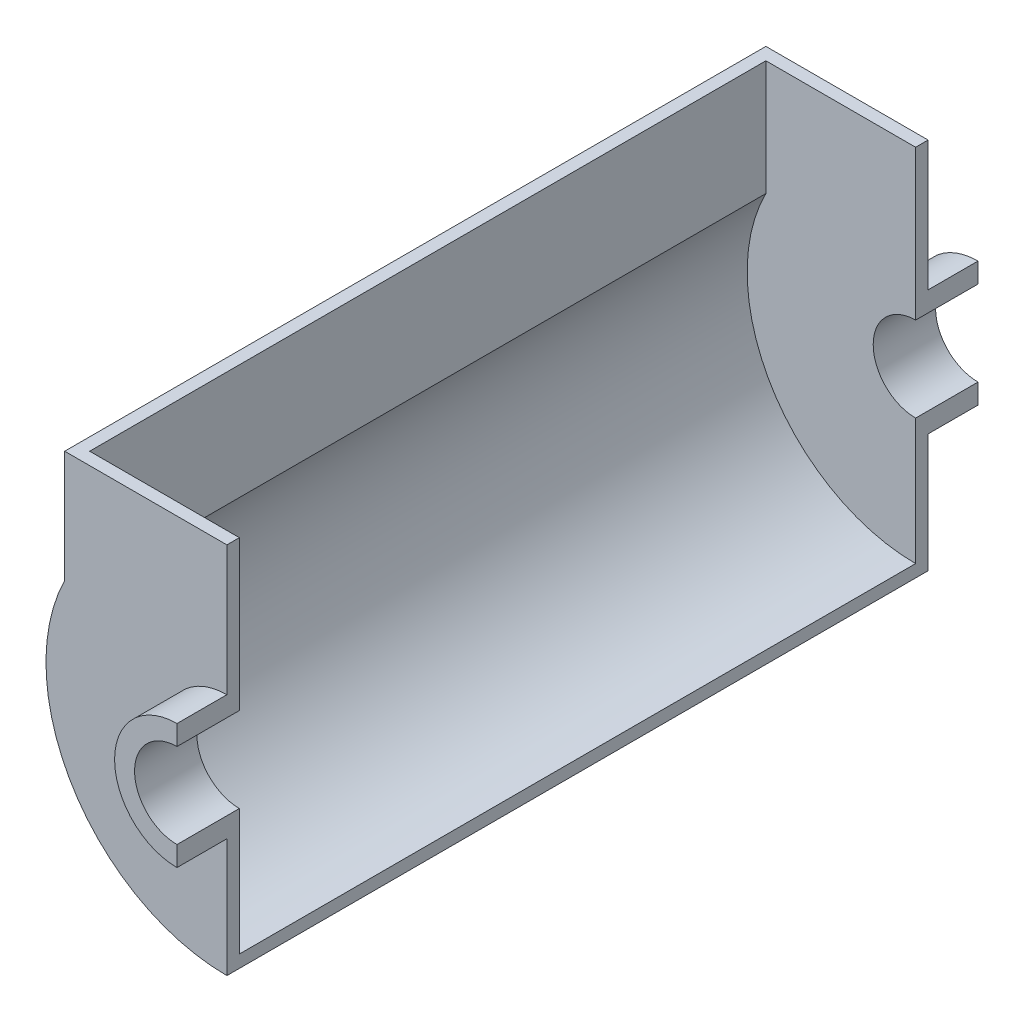
ISO-10303-21;
HEADER;
FILE_DESCRIPTION(('STEP AP214'),'2;1');
FILE_NAME('part.step','',(''),(''),'','','');
FILE_SCHEMA(('AUTOMOTIVE_DESIGN { 1 0 10303 214 1 1 1 1 }'));
ENDSEC;
DATA;
#1=APPLICATION_CONTEXT('core data for automotive mechanical design processes');
#2=APPLICATION_PROTOCOL_DEFINITION('international standard','automotive_design',2000,#1);
#3=PRODUCT_CONTEXT('',#1,'mechanical');
#4=PRODUCT('Part','Part','',(#3));
#5=PRODUCT_RELATED_PRODUCT_CATEGORY('part','',(#4));
#6=PRODUCT_DEFINITION_FORMATION('','',#4);
#7=PRODUCT_DEFINITION_CONTEXT('part definition',#1,'design');
#8=PRODUCT_DEFINITION('design','',#6,#7);
#9=PRODUCT_DEFINITION_SHAPE('','',#8);
#10=(LENGTH_UNIT() NAMED_UNIT(*) SI_UNIT(.MILLI.,.METRE.));
#11=(NAMED_UNIT(*) PLANE_ANGLE_UNIT() SI_UNIT($,.RADIAN.));
#12=(NAMED_UNIT(*) SI_UNIT($,.STERADIAN.) SOLID_ANGLE_UNIT());
#13=UNCERTAINTY_MEASURE_WITH_UNIT(LENGTH_MEASURE(1.E-05),#10,'distance_accuracy_value','');
#14=(GEOMETRIC_REPRESENTATION_CONTEXT(3) GLOBAL_UNCERTAINTY_ASSIGNED_CONTEXT((#13)) GLOBAL_UNIT_ASSIGNED_CONTEXT((#10,
#11,#12)) REPRESENTATION_CONTEXT('',''));
#15=CARTESIAN_POINT('',(0.,0.,0.));
#16=DIRECTION('',(0.,0.,1.));
#17=DIRECTION('',(1.,0.,0.));
#18=AXIS2_PLACEMENT_3D('',#15,#16,#17);
#19=CARTESIAN_POINT('',(0.,0.,-5.));
#20=DIRECTION('',(0.,0.,1.));
#21=DIRECTION('',(1.,0.,0.));
#22=AXIS2_PLACEMENT_3D('',#19,#20,#21);
#23=CYLINDRICAL_SURFACE('',#22,17.);
#24=DIRECTION('',(0.,0.,1.));
#25=VECTOR('',#24,1.);
#26=CARTESIAN_POINT('',(0.,17.,-5.));
#27=LINE('',#26,#25);
#28=CARTESIAN_POINT('',(0.,17.,-5.));
#29=VERTEX_POINT('',#28);
#30=CARTESIAN_POINT('',(0.,17.,20.));
#31=VERTEX_POINT('',#30);
#32=EDGE_CURVE('E40',#29,#31,#27,.T.);
#33=ORIENTED_EDGE('',*,*,#32,.T.);
#34=CARTESIAN_POINT('',(0.,0.,20.));
#35=DIRECTION('',(0.,0.,-1.));
#36=DIRECTION('',(1.,0.,0.));
#37=AXIS2_PLACEMENT_3D('',#34,#35,#36);
#38=CIRCLE('',#37,17.);
#39=CARTESIAN_POINT('',(0.,-17.,20.));
#40=VERTEX_POINT('',#39);
#41=EDGE_CURVE('E232',#40,#31,#38,.T.);
#42=ORIENTED_EDGE('',*,*,#41,.F.);
#43=DIRECTION('',(0.,0.,1.));
#44=VECTOR('',#43,1.);
#45=CARTESIAN_POINT('',(0.,-17.,-5.));
#46=LINE('',#45,#44);
#47=CARTESIAN_POINT('',(0.,-17.,-5.));
#48=VERTEX_POINT('',#47);
#49=EDGE_CURVE('E11',#48,#40,#46,.T.);
#50=ORIENTED_EDGE('',*,*,#49,.F.);
#51=CARTESIAN_POINT('',(0.,0.,-5.));
#52=DIRECTION('',(0.,0.,-1.));
#53=DIRECTION('',(1.,0.,0.));
#54=AXIS2_PLACEMENT_3D('',#51,#52,#53);
#55=CIRCLE('',#54,17.);
#56=EDGE_CURVE('E249',#48,#29,#55,.T.);
#57=ORIENTED_EDGE('',*,*,#56,.T.);
#58=EDGE_LOOP('',(#33,#42,#50,#57));
#59=FACE_BOUND('',#58,.T.);
#60=ADVANCED_FACE('F37',(#59),#23,.F.);
#61=CARTESIAN_POINT('',(0.,-17.,-5.));
#62=DIRECTION('',(1.,0.,0.));
#63=DIRECTION('',(0.,0.,-1.));
#64=AXIS2_PLACEMENT_3D('',#61,#62,#63);
#65=PLANE('',#64);
#66=ORIENTED_EDGE('',*,*,#49,.T.);
#67=DIRECTION('',(0.,1.,0.));
#68=VECTOR('',#67,1.);
#69=CARTESIAN_POINT('',(0.,-17.,20.));
#70=LINE('',#69,#68);
#71=CARTESIAN_POINT('',(0.,-25.,20.));
#72=VERTEX_POINT('',#71);
#73=EDGE_CURVE('E246',#72,#40,#70,.T.);
#74=ORIENTED_EDGE('',*,*,#73,.F.);
#75=DIRECTION('',(0.,0.,1.));
#76=VECTOR('',#75,1.);
#77=CARTESIAN_POINT('',(0.,-25.,-5.));
#78=LINE('',#77,#76);
#79=CARTESIAN_POINT('',(0.,-25.,0.));
#80=VERTEX_POINT('',#79);
#81=EDGE_CURVE('E45',#80,#72,#78,.T.);
#82=ORIENTED_EDGE('',*,*,#81,.F.);
#83=DIRECTION('',(0.,1.,0.));
#84=VECTOR('',#83,1.);
#85=CARTESIAN_POINT('',(0.,-25.,0.));
#86=LINE('',#85,#84);
#87=CARTESIAN_POINT('',(0.,-72.5,0.));
#88=VERTEX_POINT('',#87);
#89=EDGE_CURVE('E213',#88,#80,#86,.T.);
#90=ORIENTED_EDGE('',*,*,#89,.F.);
#91=DIRECTION('',(0.,0.,1.));
#92=VECTOR('',#91,1.);
#93=CARTESIAN_POINT('',(0.,-72.5,-5.));
#94=LINE('',#93,#92);
#95=CARTESIAN_POINT('',(0.,-72.5,-281.));
#96=VERTEX_POINT('',#95);
#97=EDGE_CURVE('E230',#96,#88,#94,.T.);
#98=ORIENTED_EDGE('',*,*,#97,.F.);
#99=DIRECTION('',(0.,1.,0.));
#100=VECTOR('',#99,1.);
#101=CARTESIAN_POINT('',(0.,-25.,-281.));
#102=LINE('',#101,#100);
#103=CARTESIAN_POINT('',(0.,-25.,-281.));
#104=VERTEX_POINT('',#103);
#105=EDGE_CURVE('E162',#96,#104,#102,.T.);
#106=ORIENTED_EDGE('',*,*,#105,.T.);
#107=DIRECTION('',(0.,0.,-1.));
#108=VECTOR('',#107,1.);
#109=CARTESIAN_POINT('',(0.,-25.,-276.));
#110=LINE('',#109,#108);
#111=CARTESIAN_POINT('',(0.,-25.,-301.));
#112=VERTEX_POINT('',#111);
#113=EDGE_CURVE('E189',#104,#112,#110,.T.);
#114=ORIENTED_EDGE('',*,*,#113,.T.);
#115=DIRECTION('',(0.,1.,0.));
#116=VECTOR('',#115,1.);
#117=CARTESIAN_POINT('',(0.,-17.,-301.));
#118=LINE('',#117,#116);
#119=CARTESIAN_POINT('',(0.,-17.,-301.));
#120=VERTEX_POINT('',#119);
#121=EDGE_CURVE('E181',#112,#120,#118,.T.);
#122=ORIENTED_EDGE('',*,*,#121,.T.);
#123=DIRECTION('',(0.,0.,-1.));
#124=VECTOR('',#123,1.);
#125=CARTESIAN_POINT('',(0.,-17.,-276.));
#126=LINE('',#125,#124);
#127=CARTESIAN_POINT('',(0.,-17.,-276.));
#128=VERTEX_POINT('',#127);
#129=EDGE_CURVE('E185',#128,#120,#126,.T.);
#130=ORIENTED_EDGE('',*,*,#129,.F.);
#131=DIRECTION('',(0.,1.,0.));
#132=VECTOR('',#131,1.);
#133=CARTESIAN_POINT('',(0.,-17.,-276.));
#134=LINE('',#133,#132);
#135=CARTESIAN_POINT('',(0.,-67.5,-276.));
#136=VERTEX_POINT('',#135);
#137=EDGE_CURVE('E177',#136,#128,#134,.T.);
#138=ORIENTED_EDGE('',*,*,#137,.F.);
#139=DIRECTION('',(0.,0.,1.));
#140=VECTOR('',#139,1.);
#141=CARTESIAN_POINT('',(0.,-67.5,-442.152038807834));
#142=LINE('',#141,#140);
#143=CARTESIAN_POINT('',(0.,-67.5,-5.));
#144=VERTEX_POINT('',#143);
#145=EDGE_CURVE('E198',#136,#144,#142,.T.);
#146=ORIENTED_EDGE('',*,*,#145,.T.);
#147=DIRECTION('',(0.,1.,0.));
#148=VECTOR('',#147,1.);
#149=CARTESIAN_POINT('',(0.,-17.,-5.));
#150=LINE('',#149,#148);
#151=EDGE_CURVE('E59',#144,#48,#150,.T.);
#152=ORIENTED_EDGE('',*,*,#151,.T.);
#153=EDGE_LOOP('',(#66,#74,#82,#90,#98,#106,#114,#122,#130,#138,#146,#152));
#154=FACE_BOUND('',#153,.T.);
#155=ADVANCED_FACE('F270',(#154),#65,.T.);
#156=CARTESIAN_POINT('',(0.,0.,-5.));
#157=DIRECTION('',(0.,0.,1.));
#158=DIRECTION('',(1.,0.,0.));
#159=AXIS2_PLACEMENT_3D('',#156,#157,#158);
#160=CYLINDRICAL_SURFACE('',#159,25.);
#161=CARTESIAN_POINT('',(0.,0.,0.));
#162=DIRECTION('',(0.,0.,-1.));
#163=DIRECTION('',(1.,0.,0.));
#164=AXIS2_PLACEMENT_3D('',#161,#162,#163);
#165=CIRCLE('',#164,25.);
#166=CARTESIAN_POINT('',(0.,25.,0.));
#167=VERTEX_POINT('',#166);
#168=EDGE_CURVE('E200',#80,#167,#165,.T.);
#169=ORIENTED_EDGE('',*,*,#168,.F.);
#170=ORIENTED_EDGE('',*,*,#81,.T.);
#171=CARTESIAN_POINT('',(0.,0.,20.));
#172=DIRECTION('',(0.,0.,1.));
#173=DIRECTION('',(1.,0.,0.));
#174=AXIS2_PLACEMENT_3D('',#171,#172,#173);
#175=CIRCLE('',#174,25.);
#176=CARTESIAN_POINT('',(0.,25.,20.));
#177=VERTEX_POINT('',#176);
#178=EDGE_CURVE('E243',#177,#72,#175,.T.);
#179=ORIENTED_EDGE('',*,*,#178,.F.);
#180=DIRECTION('',(0.,0.,1.));
#181=VECTOR('',#180,1.);
#182=CARTESIAN_POINT('',(0.,25.,-5.));
#183=LINE('',#182,#181);
#184=EDGE_CURVE('E255',#167,#177,#183,.T.);
#185=ORIENTED_EDGE('',*,*,#184,.F.);
#186=EDGE_LOOP('',(#169,#170,#179,#185));
#187=FACE_BOUND('',#186,.T.);
#188=ADVANCED_FACE('F278',(#187),#160,.T.);
#189=CARTESIAN_POINT('',(0.,25.,-5.));
#190=DIRECTION('',(1.,0.,0.));
#191=DIRECTION('',(0.,0.,-1.));
#192=AXIS2_PLACEMENT_3D('',#189,#190,#191);
#193=PLANE('',#192);
#194=DIRECTION('',(0.,1.,0.));
#195=VECTOR('',#194,1.);
#196=CARTESIAN_POINT('',(0.,25.,-5.));
#197=LINE('',#196,#195);
#198=CARTESIAN_POINT('',(0.,77.,-5.));
#199=VERTEX_POINT('',#198);
#200=EDGE_CURVE('E252',#29,#199,#197,.T.);
#201=ORIENTED_EDGE('',*,*,#200,.T.);
#202=DIRECTION('',(0.,0.,1.));
#203=VECTOR('',#202,1.);
#204=CARTESIAN_POINT('',(0.,77.,-5.));
#205=LINE('',#204,#203);
#206=CARTESIAN_POINT('',(0.,77.,0.));
#207=VERTEX_POINT('',#206);
#208=EDGE_CURVE('E212',#199,#207,#205,.T.);
#209=ORIENTED_EDGE('',*,*,#208,.T.);
#210=DIRECTION('',(0.,1.,0.));
#211=VECTOR('',#210,1.);
#212=CARTESIAN_POINT('',(0.,25.,0.));
#213=LINE('',#212,#211);
#214=EDGE_CURVE('E216',#167,#207,#213,.T.);
#215=ORIENTED_EDGE('',*,*,#214,.F.);
#216=ORIENTED_EDGE('',*,*,#184,.T.);
#217=DIRECTION('',(0.,1.,0.));
#218=VECTOR('',#217,1.);
#219=CARTESIAN_POINT('',(0.,25.,20.));
#220=LINE('',#219,#218);
#221=EDGE_CURVE('E240',#31,#177,#220,.T.);
#222=ORIENTED_EDGE('',*,*,#221,.F.);
#223=ORIENTED_EDGE('',*,*,#32,.F.);
#224=EDGE_LOOP('',(#201,#209,#215,#216,#222,#223));
#225=FACE_BOUND('',#224,.T.);
#226=ADVANCED_FACE('F263',(#225),#193,.T.);
#227=CARTESIAN_POINT('',(0.,0.,-5.));
#228=DIRECTION('',(0.,0.,1.));
#229=DIRECTION('',(1.,0.,0.));
#230=AXIS2_PLACEMENT_3D('',#227,#228,#229);
#231=PLANE('',#230);
#232=ORIENTED_EDGE('',*,*,#151,.F.);
#233=CARTESIAN_POINT('',(0.,0.,-5.));
#234=DIRECTION('',(0.,0.,-1.));
#235=DIRECTION('',(-1.,0.,0.));
#236=AXIS2_PLACEMENT_3D('',#233,#234,#235);
#237=CIRCLE('',#236,67.5);
#238=CARTESIAN_POINT('',(-60.,30.9232921921324,-5.));
#239=VERTEX_POINT('',#238);
#240=EDGE_CURVE('E196',#144,#239,#237,.T.);
#241=ORIENTED_EDGE('',*,*,#240,.T.);
#242=DIRECTION('',(0.,-1.,0.));
#243=VECTOR('',#242,1.);
#244=CARTESIAN_POINT('',(-60.,77.,-5.));
#245=LINE('',#244,#243);
#246=CARTESIAN_POINT('',(-60.,77.,-5.));
#247=VERTEX_POINT('',#246);
#248=EDGE_CURVE('E53',#247,#239,#245,.T.);
#249=ORIENTED_EDGE('',*,*,#248,.F.);
#250=DIRECTION('',(-1.,0.,0.));
#251=VECTOR('',#250,1.);
#252=CARTESIAN_POINT('',(0.,77.,-5.));
#253=LINE('',#252,#251);
#254=EDGE_CURVE('E210',#199,#247,#253,.T.);
#255=ORIENTED_EDGE('',*,*,#254,.F.);
#256=ORIENTED_EDGE('',*,*,#200,.F.);
#257=ORIENTED_EDGE('',*,*,#56,.F.);
#258=EDGE_LOOP('',(#232,#241,#249,#255,#256,#257));
#259=FACE_BOUND('',#258,.T.);
#260=ADVANCED_FACE('F272',(#259),#231,.F.);
#261=CARTESIAN_POINT('',(0.,0.,20.));
#262=DIRECTION('',(0.,0.,1.));
#263=DIRECTION('',(1.,0.,0.));
#264=AXIS2_PLACEMENT_3D('',#261,#262,#263);
#265=PLANE('',#264);
#266=ORIENTED_EDGE('',*,*,#41,.T.);
#267=ORIENTED_EDGE('',*,*,#221,.T.);
#268=ORIENTED_EDGE('',*,*,#178,.T.);
#269=ORIENTED_EDGE('',*,*,#73,.T.);
#270=EDGE_LOOP('',(#266,#267,#268,#269));
#271=FACE_BOUND('',#270,.T.);
#272=ADVANCED_FACE('F266',(#271),#265,.T.);
#273=CARTESIAN_POINT('',(0.,0.,-5.));
#274=DIRECTION('',(0.,0.,1.));
#275=DIRECTION('',(1.,0.,0.));
#276=AXIS2_PLACEMENT_3D('',#273,#274,#275);
#277=CYLINDRICAL_SURFACE('',#276,72.5);
#278=CARTESIAN_POINT('',(0.,0.,0.));
#279=DIRECTION('',(0.,0.,1.));
#280=DIRECTION('',(1.,0.,0.));
#281=AXIS2_PLACEMENT_3D('',#278,#279,#280);
#282=CIRCLE('',#281,72.5);
#283=CARTESIAN_POINT('',(-65.,32.1130814466628,0.));
#284=VERTEX_POINT('',#283);
#285=EDGE_CURVE('E225',#284,#88,#282,.T.);
#286=ORIENTED_EDGE('',*,*,#285,.F.);
#287=DIRECTION('',(0.,0.,1.));
#288=VECTOR('',#287,1.);
#289=CARTESIAN_POINT('',(-65.,32.1130814466628,-5.));
#290=LINE('',#289,#288);
#291=CARTESIAN_POINT('',(-65.,32.1130814466628,-281.));
#292=VERTEX_POINT('',#291);
#293=EDGE_CURVE('E233',#292,#284,#290,.T.);
#294=ORIENTED_EDGE('',*,*,#293,.F.);
#295=CARTESIAN_POINT('',(0.,0.,-281.));
#296=DIRECTION('',(0.,0.,1.));
#297=DIRECTION('',(1.,0.,0.));
#298=AXIS2_PLACEMENT_3D('',#295,#296,#297);
#299=CIRCLE('',#298,72.5);
#300=EDGE_CURVE('E486',#292,#96,#299,.T.);
#301=ORIENTED_EDGE('',*,*,#300,.T.);
#302=ORIENTED_EDGE('',*,*,#97,.T.);
#303=EDGE_LOOP('',(#286,#294,#301,#302));
#304=FACE_BOUND('',#303,.T.);
#305=ADVANCED_FACE('F319',(#304),#277,.T.);
#306=CARTESIAN_POINT('',(-65.,77.,-5.));
#307=DIRECTION('',(-1.,0.,0.));
#308=DIRECTION('',(0.,-1.,0.));
#309=AXIS2_PLACEMENT_3D('',#306,#307,#308);
#310=PLANE('',#309);
#311=DIRECTION('',(0.,-1.,0.));
#312=VECTOR('',#311,1.);
#313=CARTESIAN_POINT('',(-65.,77.,0.));
#314=LINE('',#313,#312);
#315=CARTESIAN_POINT('',(-65.,77.,0.));
#316=VERTEX_POINT('',#315);
#317=EDGE_CURVE('E222',#316,#284,#314,.T.);
#318=ORIENTED_EDGE('',*,*,#317,.F.);
#319=DIRECTION('',(0.,0.,1.));
#320=VECTOR('',#319,1.);
#321=CARTESIAN_POINT('',(-65.,77.,-5.));
#322=LINE('',#321,#320);
#323=CARTESIAN_POINT('',(-65.,77.,-281.));
#324=VERTEX_POINT('',#323);
#325=EDGE_CURVE('E235',#324,#316,#322,.T.);
#326=ORIENTED_EDGE('',*,*,#325,.F.);
#327=DIRECTION('',(0.,-1.,0.));
#328=VECTOR('',#327,1.);
#329=CARTESIAN_POINT('',(-65.,77.,-281.));
#330=LINE('',#329,#328);
#331=EDGE_CURVE('E488',#324,#292,#330,.T.);
#332=ORIENTED_EDGE('',*,*,#331,.T.);
#333=ORIENTED_EDGE('',*,*,#293,.T.);
#334=EDGE_LOOP('',(#318,#326,#332,#333));
#335=FACE_BOUND('',#334,.T.);
#336=ADVANCED_FACE('F323',(#335),#310,.T.);
#337=CARTESIAN_POINT('',(0.,77.,-5.));
#338=DIRECTION('',(0.,1.,0.));
#339=DIRECTION('',(-1.,0.,0.));
#340=AXIS2_PLACEMENT_3D('',#337,#338,#339);
#341=PLANE('',#340);
#342=DIRECTION('',(-1.,0.,0.));
#343=VECTOR('',#342,1.);
#344=CARTESIAN_POINT('',(0.,77.,0.));
#345=LINE('',#344,#343);
#346=EDGE_CURVE('E219',#207,#316,#345,.T.);
#347=ORIENTED_EDGE('',*,*,#346,.F.);
#348=ORIENTED_EDGE('',*,*,#208,.F.);
#349=ORIENTED_EDGE('',*,*,#254,.T.);
#350=DIRECTION('',(0.,0.,1.));
#351=VECTOR('',#350,1.);
#352=CARTESIAN_POINT('',(-60.,77.,-442.152038807834));
#353=LINE('',#352,#351);
#354=CARTESIAN_POINT('',(-60.,77.,-276.));
#355=VERTEX_POINT('',#354);
#356=EDGE_CURVE('E158',#355,#247,#353,.T.);
#357=ORIENTED_EDGE('',*,*,#356,.F.);
#358=DIRECTION('',(-1.,0.,0.));
#359=VECTOR('',#358,1.);
#360=CARTESIAN_POINT('',(0.,77.,-276.));
#361=LINE('',#360,#359);
#362=CARTESIAN_POINT('',(0.,77.,-276.));
#363=VERTEX_POINT('',#362);
#364=EDGE_CURVE('E150',#363,#355,#361,.T.);
#365=ORIENTED_EDGE('',*,*,#364,.F.);
#366=DIRECTION('',(0.,0.,-1.));
#367=VECTOR('',#366,1.);
#368=CARTESIAN_POINT('',(0.,77.,-276.));
#369=LINE('',#368,#367);
#370=CARTESIAN_POINT('',(0.,77.,-281.));
#371=VERTEX_POINT('',#370);
#372=EDGE_CURVE('E155',#363,#371,#369,.T.);
#373=ORIENTED_EDGE('',*,*,#372,.T.);
#374=DIRECTION('',(-1.,0.,0.));
#375=VECTOR('',#374,1.);
#376=CARTESIAN_POINT('',(0.,77.,-281.));
#377=LINE('',#376,#375);
#378=EDGE_CURVE('E504',#371,#324,#377,.T.);
#379=ORIENTED_EDGE('',*,*,#378,.T.);
#380=ORIENTED_EDGE('',*,*,#325,.T.);
#381=EDGE_LOOP('',(#347,#348,#349,#357,#365,#373,#379,#380));
#382=FACE_BOUND('',#381,.T.);
#383=ADVANCED_FACE('F153',(#382),#341,.T.);
#384=CARTESIAN_POINT('',(0.,0.,0.));
#385=DIRECTION('',(0.,0.,1.));
#386=DIRECTION('',(1.,0.,0.));
#387=AXIS2_PLACEMENT_3D('',#384,#385,#386);
#388=PLANE('',#387);
#389=ORIENTED_EDGE('',*,*,#168,.T.);
#390=ORIENTED_EDGE('',*,*,#214,.T.);
#391=ORIENTED_EDGE('',*,*,#346,.T.);
#392=ORIENTED_EDGE('',*,*,#317,.T.);
#393=ORIENTED_EDGE('',*,*,#285,.T.);
#394=ORIENTED_EDGE('',*,*,#89,.T.);
#395=EDGE_LOOP('',(#389,#390,#391,#392,#393,#394));
#396=FACE_BOUND('',#395,.T.);
#397=ADVANCED_FACE('F276',(#396),#388,.T.);
#398=CARTESIAN_POINT('',(0.,0.,-442.152038807834));
#399=DIRECTION('',(0.,0.,1.));
#400=DIRECTION('',(1.,0.,0.));
#401=AXIS2_PLACEMENT_3D('',#398,#399,#400);
#402=CYLINDRICAL_SURFACE('',#401,67.5);
#403=ORIENTED_EDGE('',*,*,#145,.F.);
#404=CARTESIAN_POINT('',(0.,0.,-276.));
#405=DIRECTION('',(0.,0.,-1.));
#406=DIRECTION('',(-1.,0.,0.));
#407=AXIS2_PLACEMENT_3D('',#404,#405,#406);
#408=CIRCLE('',#407,67.5);
#409=CARTESIAN_POINT('',(-60.,30.9232921921324,-276.));
#410=VERTEX_POINT('',#409);
#411=EDGE_CURVE('E202',#136,#410,#408,.T.);
#412=ORIENTED_EDGE('',*,*,#411,.T.);
#413=DIRECTION('',(0.,0.,1.));
#414=VECTOR('',#413,1.);
#415=CARTESIAN_POINT('',(-60.,30.9232921921324,-442.152038807834));
#416=LINE('',#415,#414);
#417=EDGE_CURVE('E205',#410,#239,#416,.T.);
#418=ORIENTED_EDGE('',*,*,#417,.T.);
#419=ORIENTED_EDGE('',*,*,#240,.F.);
#420=EDGE_LOOP('',(#403,#412,#418,#419));
#421=FACE_BOUND('',#420,.T.);
#422=ADVANCED_FACE('F349',(#421),#402,.F.);
#423=CARTESIAN_POINT('',(-60.,77.,-442.152038807834));
#424=DIRECTION('',(-1.,0.,0.));
#425=DIRECTION('',(0.,0.,1.));
#426=AXIS2_PLACEMENT_3D('',#423,#424,#425);
#427=PLANE('',#426);
#428=DIRECTION('',(0.,-1.,0.));
#429=VECTOR('',#428,1.);
#430=CARTESIAN_POINT('',(-60.,77.,-276.));
#431=LINE('',#430,#429);
#432=EDGE_CURVE('E188',#355,#410,#431,.T.);
#433=ORIENTED_EDGE('',*,*,#432,.F.);
#434=ORIENTED_EDGE('',*,*,#356,.T.);
#435=ORIENTED_EDGE('',*,*,#248,.T.);
#436=ORIENTED_EDGE('',*,*,#417,.F.);
#437=EDGE_LOOP('',(#433,#434,#435,#436));
#438=FACE_BOUND('',#437,.T.);
#439=ADVANCED_FACE('F353',(#438),#427,.F.);
#440=CARTESIAN_POINT('',(0.,0.,-276.));
#441=DIRECTION('',(0.,0.,-1.));
#442=DIRECTION('',(1.,0.,0.));
#443=AXIS2_PLACEMENT_3D('',#440,#441,#442);
#444=CYLINDRICAL_SURFACE('',#443,17.);
#445=DIRECTION('',(0.,0.,-1.));
#446=VECTOR('',#445,1.);
#447=CARTESIAN_POINT('',(0.,17.,-276.));
#448=LINE('',#447,#446);
#449=CARTESIAN_POINT('',(0.,17.,-276.));
#450=VERTEX_POINT('',#449);
#451=CARTESIAN_POINT('',(0.,17.,-301.));
#452=VERTEX_POINT('',#451);
#453=EDGE_CURVE('E179',#450,#452,#448,.T.);
#454=ORIENTED_EDGE('',*,*,#453,.F.);
#455=CARTESIAN_POINT('',(0.,0.,-276.));
#456=DIRECTION('',(0.,0.,-1.));
#457=DIRECTION('',(1.,0.,0.));
#458=AXIS2_PLACEMENT_3D('',#455,#456,#457);
#459=CIRCLE('',#458,17.);
#460=EDGE_CURVE('E175',#128,#450,#459,.T.);
#461=ORIENTED_EDGE('',*,*,#460,.F.);
#462=ORIENTED_EDGE('',*,*,#129,.T.);
#463=CARTESIAN_POINT('',(0.,0.,-301.));
#464=DIRECTION('',(0.,0.,-1.));
#465=DIRECTION('',(1.,0.,0.));
#466=AXIS2_PLACEMENT_3D('',#463,#464,#465);
#467=CIRCLE('',#466,17.);
#468=EDGE_CURVE('E171',#120,#452,#467,.T.);
#469=ORIENTED_EDGE('',*,*,#468,.T.);
#470=EDGE_LOOP('',(#454,#461,#462,#469));
#471=FACE_BOUND('',#470,.T.);
#472=ADVANCED_FACE('F363',(#471),#444,.F.);
#473=CARTESIAN_POINT('',(0.,0.,-276.));
#474=DIRECTION('',(0.,0.,-1.));
#475=DIRECTION('',(1.,0.,0.));
#476=AXIS2_PLACEMENT_3D('',#473,#474,#475);
#477=CYLINDRICAL_SURFACE('',#476,25.);
#478=CARTESIAN_POINT('',(0.,0.,-281.));
#479=DIRECTION('',(0.,0.,-1.));
#480=DIRECTION('',(1.,0.,0.));
#481=AXIS2_PLACEMENT_3D('',#478,#479,#480);
#482=CIRCLE('',#481,25.);
#483=CARTESIAN_POINT('',(0.,25.,-281.));
#484=VERTEX_POINT('',#483);
#485=EDGE_CURVE('E477',#104,#484,#482,.T.);
#486=ORIENTED_EDGE('',*,*,#485,.T.);
#487=DIRECTION('',(0.,0.,-1.));
#488=VECTOR('',#487,1.);
#489=CARTESIAN_POINT('',(0.,25.,-276.));
#490=LINE('',#489,#488);
#491=CARTESIAN_POINT('',(0.,25.,-301.));
#492=VERTEX_POINT('',#491);
#493=EDGE_CURVE('E192',#484,#492,#490,.T.);
#494=ORIENTED_EDGE('',*,*,#493,.T.);
#495=CARTESIAN_POINT('',(0.,0.,-301.));
#496=DIRECTION('',(0.,0.,1.));
#497=DIRECTION('',(1.,0.,0.));
#498=AXIS2_PLACEMENT_3D('',#495,#496,#497);
#499=CIRCLE('',#498,25.);
#500=EDGE_CURVE('E483',#492,#112,#499,.T.);
#501=ORIENTED_EDGE('',*,*,#500,.T.);
#502=ORIENTED_EDGE('',*,*,#113,.F.);
#503=EDGE_LOOP('',(#486,#494,#501,#502));
#504=FACE_BOUND('',#503,.T.);
#505=ADVANCED_FACE('F373',(#504),#477,.T.);
#506=CARTESIAN_POINT('',(0.,25.,-276.));
#507=DIRECTION('',(1.,0.,0.));
#508=DIRECTION('',(0.,0.,1.));
#509=AXIS2_PLACEMENT_3D('',#506,#507,#508);
#510=PLANE('',#509);
#511=DIRECTION('',(0.,1.,0.));
#512=VECTOR('',#511,1.);
#513=CARTESIAN_POINT('',(0.,25.,-276.));
#514=LINE('',#513,#512);
#515=EDGE_CURVE('E167',#450,#363,#514,.T.);
#516=ORIENTED_EDGE('',*,*,#515,.F.);
#517=ORIENTED_EDGE('',*,*,#453,.T.);
#518=DIRECTION('',(0.,1.,0.));
#519=VECTOR('',#518,1.);
#520=CARTESIAN_POINT('',(0.,25.,-301.));
#521=LINE('',#520,#519);
#522=EDGE_CURVE('E494',#452,#492,#521,.T.);
#523=ORIENTED_EDGE('',*,*,#522,.T.);
#524=ORIENTED_EDGE('',*,*,#493,.F.);
#525=DIRECTION('',(0.,1.,0.));
#526=VECTOR('',#525,1.);
#527=CARTESIAN_POINT('',(0.,25.,-281.));
#528=LINE('',#527,#526);
#529=EDGE_CURVE('E170',#484,#371,#528,.T.);
#530=ORIENTED_EDGE('',*,*,#529,.T.);
#531=ORIENTED_EDGE('',*,*,#372,.F.);
#532=EDGE_LOOP('',(#516,#517,#523,#524,#530,#531));
#533=FACE_BOUND('',#532,.T.);
#534=ADVANCED_FACE('F165',(#533),#510,.T.);
#535=CARTESIAN_POINT('',(0.,0.,-276.));
#536=DIRECTION('',(0.,0.,-1.));
#537=DIRECTION('',(1.,0.,0.));
#538=AXIS2_PLACEMENT_3D('',#535,#536,#537);
#539=PLANE('',#538);
#540=ORIENTED_EDGE('',*,*,#364,.T.);
#541=ORIENTED_EDGE('',*,*,#432,.T.);
#542=ORIENTED_EDGE('',*,*,#411,.F.);
#543=ORIENTED_EDGE('',*,*,#137,.T.);
#544=ORIENTED_EDGE('',*,*,#460,.T.);
#545=ORIENTED_EDGE('',*,*,#515,.T.);
#546=EDGE_LOOP('',(#540,#541,#542,#543,#544,#545));
#547=FACE_BOUND('',#546,.T.);
#548=ADVANCED_FACE('F173',(#547),#539,.F.);
#549=CARTESIAN_POINT('',(0.,0.,-301.));
#550=DIRECTION('',(0.,0.,-1.));
#551=DIRECTION('',(1.,0.,0.));
#552=AXIS2_PLACEMENT_3D('',#549,#550,#551);
#553=PLANE('',#552);
#554=ORIENTED_EDGE('',*,*,#468,.F.);
#555=ORIENTED_EDGE('',*,*,#121,.F.);
#556=ORIENTED_EDGE('',*,*,#500,.F.);
#557=ORIENTED_EDGE('',*,*,#522,.F.);
#558=EDGE_LOOP('',(#554,#555,#556,#557));
#559=FACE_BOUND('',#558,.T.);
#560=ADVANCED_FACE('F401',(#559),#553,.T.);
#561=CARTESIAN_POINT('',(0.,0.,-281.));
#562=DIRECTION('',(0.,0.,-1.));
#563=DIRECTION('',(1.,0.,0.));
#564=AXIS2_PLACEMENT_3D('',#561,#562,#563);
#565=PLANE('',#564);
#566=ORIENTED_EDGE('',*,*,#485,.F.);
#567=ORIENTED_EDGE('',*,*,#105,.F.);
#568=ORIENTED_EDGE('',*,*,#300,.F.);
#569=ORIENTED_EDGE('',*,*,#331,.F.);
#570=ORIENTED_EDGE('',*,*,#378,.F.);
#571=ORIENTED_EDGE('',*,*,#529,.F.);
#572=EDGE_LOOP('',(#566,#567,#568,#569,#570,#571));
#573=FACE_BOUND('',#572,.T.);
#574=ADVANCED_FACE('F411',(#573),#565,.T.);
#575=CLOSED_SHELL('',(#60,#155,#188,#226,#260,#272,#305,#336,#383,#397,#422,#439,#472,#505,#534,
#548,#560,#574));
#576=MANIFOLD_SOLID_BREP('B2',#575);
#577=ADVANCED_BREP_SHAPE_REPRESENTATION('',(#18,#576),#14);
#578=SHAPE_DEFINITION_REPRESENTATION(#9,#577);
ENDSEC;
END-ISO-10303-21;
